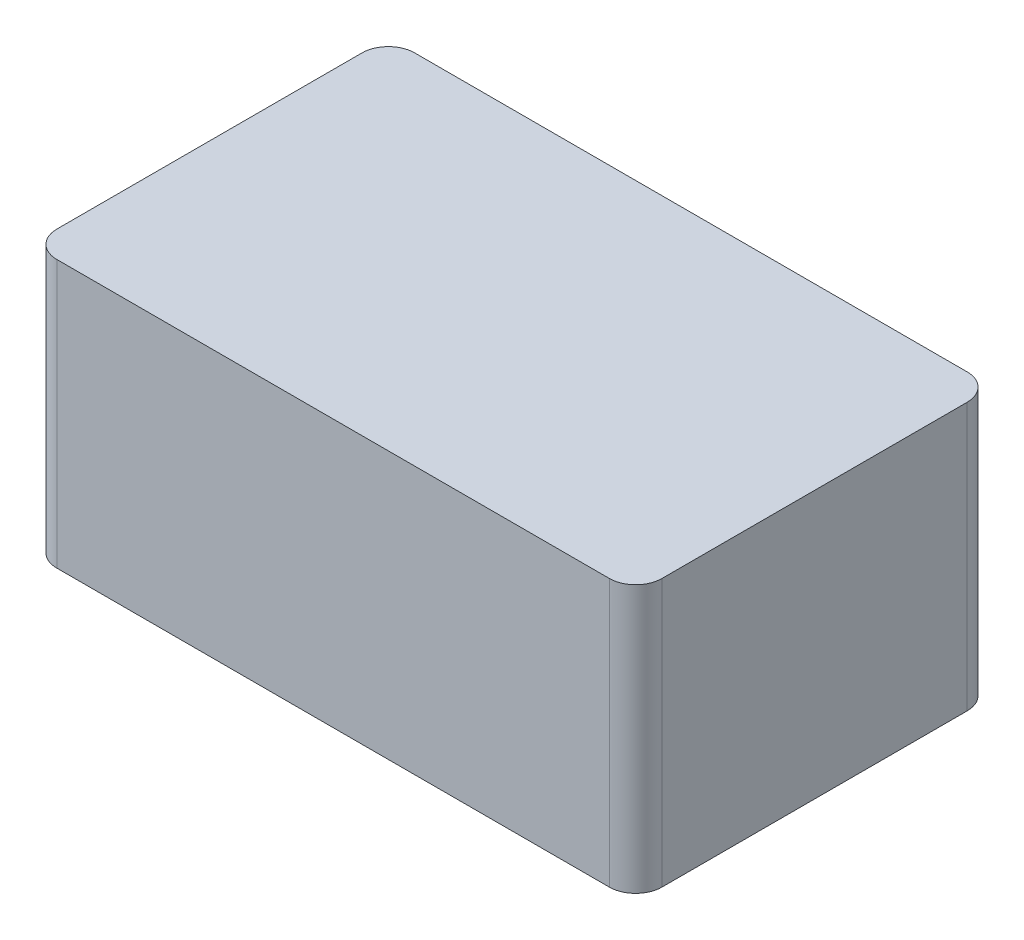
ISO-10303-21;
HEADER;
FILE_DESCRIPTION(('STEP AP214'),'2;1');
FILE_NAME('part.step','',(''),(''),'','','');
FILE_SCHEMA(('AUTOMOTIVE_DESIGN { 1 0 10303 214 1 1 1 1 }'));
ENDSEC;
DATA;
#1=APPLICATION_CONTEXT('core data for automotive mechanical design processes');
#2=APPLICATION_PROTOCOL_DEFINITION('international standard','automotive_design',2000,#1);
#3=PRODUCT_CONTEXT('',#1,'mechanical');
#4=PRODUCT('Part','Part','',(#3));
#5=PRODUCT_RELATED_PRODUCT_CATEGORY('part','',(#4));
#6=PRODUCT_DEFINITION_FORMATION('','',#4);
#7=PRODUCT_DEFINITION_CONTEXT('part definition',#1,'design');
#8=PRODUCT_DEFINITION('design','',#6,#7);
#9=PRODUCT_DEFINITION_SHAPE('','',#8);
#10=(LENGTH_UNIT() NAMED_UNIT(*) SI_UNIT(.MILLI.,.METRE.));
#11=(NAMED_UNIT(*) PLANE_ANGLE_UNIT() SI_UNIT($,.RADIAN.));
#12=(NAMED_UNIT(*) SI_UNIT($,.STERADIAN.) SOLID_ANGLE_UNIT());
#13=UNCERTAINTY_MEASURE_WITH_UNIT(LENGTH_MEASURE(1.E-05),#10,'distance_accuracy_value','');
#14=(GEOMETRIC_REPRESENTATION_CONTEXT(3) GLOBAL_UNCERTAINTY_ASSIGNED_CONTEXT((#13)) GLOBAL_UNIT_ASSIGNED_CONTEXT((#10,
#11,#12)) REPRESENTATION_CONTEXT('',''));
#15=CARTESIAN_POINT('',(0.,0.,0.));
#16=DIRECTION('',(0.,0.,1.));
#17=DIRECTION('',(1.,0.,0.));
#18=AXIS2_PLACEMENT_3D('',#15,#16,#17);
#19=CARTESIAN_POINT('',(-30.0487804878049,50.8,-22.6829268292683));
#20=DIRECTION('',(1.,0.,0.));
#21=DIRECTION('',(0.,0.,-1.));
#22=AXIS2_PLACEMENT_3D('',#19,#20,#21);
#23=PLANE('',#22);
#24=DIRECTION('',(0.,0.,1.));
#25=VECTOR('',#24,1.);
#26=CARTESIAN_POINT('',(-30.0487804878049,50.8,-22.6829268292683));
#27=LINE('',#26,#25);
#28=CARTESIAN_POINT('',(-30.0487804878049,50.8,-17.6829268292683));
#29=VERTEX_POINT('',#28);
#30=CARTESIAN_POINT('',(-30.0487804878049,50.8,40.3170731707317));
#31=VERTEX_POINT('',#30);
#32=EDGE_CURVE('E128',#29,#31,#27,.T.);
#33=ORIENTED_EDGE('',*,*,#32,.F.);
#34=DIRECTION('',(0.,-1.,0.));
#35=VECTOR('',#34,1.);
#36=CARTESIAN_POINT('',(-30.0487804878049,50.8,-17.6829268292683));
#37=LINE('',#36,#35);
#38=CARTESIAN_POINT('',(-30.0487804878049,0.,-17.6829268292683));
#39=VERTEX_POINT('',#38);
#40=EDGE_CURVE('E11',#29,#39,#37,.T.);
#41=ORIENTED_EDGE('',*,*,#40,.T.);
#42=DIRECTION('',(0.,0.,1.));
#43=VECTOR('',#42,1.);
#44=CARTESIAN_POINT('',(-30.0487804878049,0.,-22.6829268292683));
#45=LINE('',#44,#43);
#46=CARTESIAN_POINT('',(-30.0487804878049,0.,40.3170731707317));
#47=VERTEX_POINT('',#46);
#48=EDGE_CURVE('E159',#39,#47,#45,.T.);
#49=ORIENTED_EDGE('',*,*,#48,.T.);
#50=DIRECTION('',(0.,-1.,0.));
#51=VECTOR('',#50,1.);
#52=CARTESIAN_POINT('',(-30.0487804878049,50.8,40.3170731707317));
#53=LINE('',#52,#51);
#54=EDGE_CURVE('E42',#47,#31,#53,.F.);
#55=ORIENTED_EDGE('',*,*,#54,.T.);
#56=EDGE_LOOP('',(#33,#41,#49,#55));
#57=FACE_BOUND('',#56,.T.);
#58=ADVANCED_FACE('F34',(#57),#23,.F.);
#59=CARTESIAN_POINT('',(-30.0487804878049,50.8,45.3170731707317));
#60=DIRECTION('',(0.,0.,-1.));
#61=DIRECTION('',(-1.,0.,0.));
#62=AXIS2_PLACEMENT_3D('',#59,#60,#61);
#63=PLANE('',#62);
#64=DIRECTION('',(1.,0.,0.));
#65=VECTOR('',#64,1.);
#66=CARTESIAN_POINT('',(-30.0487804878049,0.,45.3170731707317));
#67=LINE('',#66,#65);
#68=CARTESIAN_POINT('',(-25.0487804878049,0.,45.3170731707317));
#69=VERTEX_POINT('',#68);
#70=CARTESIAN_POINT('',(79.9512195121951,0.,45.3170731707317));
#71=VERTEX_POINT('',#70);
#72=EDGE_CURVE('E133',#69,#71,#67,.T.);
#73=ORIENTED_EDGE('',*,*,#72,.T.);
#74=DIRECTION('',(0.,-1.,0.));
#75=VECTOR('',#74,1.);
#76=CARTESIAN_POINT('',(79.9512195121951,50.8,45.3170731707317));
#77=LINE('',#76,#75);
#78=CARTESIAN_POINT('',(79.9512195121951,50.8,45.3170731707317));
#79=VERTEX_POINT('',#78);
#80=EDGE_CURVE('E49',#71,#79,#77,.F.);
#81=ORIENTED_EDGE('',*,*,#80,.T.);
#82=DIRECTION('',(1.,0.,0.));
#83=VECTOR('',#82,1.);
#84=CARTESIAN_POINT('',(-30.0487804878049,50.8,45.3170731707317));
#85=LINE('',#84,#83);
#86=CARTESIAN_POINT('',(-25.0487804878049,50.8,45.3170731707317));
#87=VERTEX_POINT('',#86);
#88=EDGE_CURVE('E131',#87,#79,#85,.T.);
#89=ORIENTED_EDGE('',*,*,#88,.F.);
#90=DIRECTION('',(0.,-1.,0.));
#91=VECTOR('',#90,1.);
#92=CARTESIAN_POINT('',(-25.0487804878049,50.8,45.3170731707317));
#93=LINE('',#92,#91);
#94=EDGE_CURVE('E151',#87,#69,#93,.T.);
#95=ORIENTED_EDGE('',*,*,#94,.T.);
#96=EDGE_LOOP('',(#73,#81,#89,#95));
#97=FACE_BOUND('',#96,.T.);
#98=ADVANCED_FACE('F166',(#97),#63,.F.);
#99=CARTESIAN_POINT('',(84.9512195121951,50.8,-22.6829268292683));
#100=DIRECTION('',(-1.,0.,0.));
#101=DIRECTION('',(0.,0.,1.));
#102=AXIS2_PLACEMENT_3D('',#99,#100,#101);
#103=PLANE('',#102);
#104=DIRECTION('',(0.,0.,-1.));
#105=VECTOR('',#104,1.);
#106=CARTESIAN_POINT('',(84.9512195121951,0.,-22.6829268292683));
#107=LINE('',#106,#105);
#108=CARTESIAN_POINT('',(84.9512195121951,0.,40.3170731707317));
#109=VERTEX_POINT('',#108);
#110=CARTESIAN_POINT('',(84.9512195121951,0.,-17.6829268292683));
#111=VERTEX_POINT('',#110);
#112=EDGE_CURVE('E129',#109,#111,#107,.T.);
#113=ORIENTED_EDGE('',*,*,#112,.T.);
#114=DIRECTION('',(0.,-1.,0.));
#115=VECTOR('',#114,1.);
#116=CARTESIAN_POINT('',(84.9512195121951,50.8,-17.6829268292683));
#117=LINE('',#116,#115);
#118=CARTESIAN_POINT('',(84.9512195121951,50.8,-17.6829268292683));
#119=VERTEX_POINT('',#118);
#120=EDGE_CURVE('E106',#111,#119,#117,.F.);
#121=ORIENTED_EDGE('',*,*,#120,.T.);
#122=DIRECTION('',(0.,0.,-1.));
#123=VECTOR('',#122,1.);
#124=CARTESIAN_POINT('',(84.9512195121951,50.8,-22.6829268292683));
#125=LINE('',#124,#123);
#126=CARTESIAN_POINT('',(84.9512195121951,50.8,40.3170731707317));
#127=VERTEX_POINT('',#126);
#128=EDGE_CURVE('E170',#127,#119,#125,.T.);
#129=ORIENTED_EDGE('',*,*,#128,.F.);
#130=DIRECTION('',(0.,-1.,0.));
#131=VECTOR('',#130,1.);
#132=CARTESIAN_POINT('',(84.9512195121951,50.8,40.3170731707317));
#133=LINE('',#132,#131);
#134=EDGE_CURVE('E111',#127,#109,#133,.T.);
#135=ORIENTED_EDGE('',*,*,#134,.T.);
#136=EDGE_LOOP('',(#113,#121,#129,#135));
#137=FACE_BOUND('',#136,.T.);
#138=ADVANCED_FACE('F178',(#137),#103,.F.);
#139=CARTESIAN_POINT('',(-30.0487804878049,50.8,-22.6829268292683));
#140=DIRECTION('',(0.,0.,1.));
#141=DIRECTION('',(1.,0.,0.));
#142=AXIS2_PLACEMENT_3D('',#139,#140,#141);
#143=PLANE('',#142);
#144=DIRECTION('',(-1.,0.,0.));
#145=VECTOR('',#144,1.);
#146=CARTESIAN_POINT('',(-30.0487804878049,50.8,-22.6829268292683));
#147=LINE('',#146,#145);
#148=CARTESIAN_POINT('',(79.9512195121951,50.8,-22.6829268292683));
#149=VERTEX_POINT('',#148);
#150=CARTESIAN_POINT('',(-25.0487804878049,50.8,-22.6829268292683));
#151=VERTEX_POINT('',#150);
#152=EDGE_CURVE('E121',#149,#151,#147,.T.);
#153=ORIENTED_EDGE('',*,*,#152,.F.);
#154=DIRECTION('',(0.,-1.,0.));
#155=VECTOR('',#154,1.);
#156=CARTESIAN_POINT('',(79.9512195121951,50.8,-22.6829268292683));
#157=LINE('',#156,#155);
#158=CARTESIAN_POINT('',(79.9512195121951,0.,-22.6829268292683));
#159=VERTEX_POINT('',#158);
#160=EDGE_CURVE('E105',#149,#159,#157,.T.);
#161=ORIENTED_EDGE('',*,*,#160,.T.);
#162=DIRECTION('',(-1.,0.,0.));
#163=VECTOR('',#162,1.);
#164=CARTESIAN_POINT('',(-30.0487804878049,0.,-22.6829268292683));
#165=LINE('',#164,#163);
#166=CARTESIAN_POINT('',(-25.0487804878049,0.,-22.6829268292683));
#167=VERTEX_POINT('',#166);
#168=EDGE_CURVE('E118',#159,#167,#165,.T.);
#169=ORIENTED_EDGE('',*,*,#168,.T.);
#170=DIRECTION('',(0.,-1.,0.));
#171=VECTOR('',#170,1.);
#172=CARTESIAN_POINT('',(-25.0487804878049,50.8,-22.6829268292683));
#173=LINE('',#172,#171);
#174=EDGE_CURVE('E123',#167,#151,#173,.F.);
#175=ORIENTED_EDGE('',*,*,#174,.T.);
#176=EDGE_LOOP('',(#153,#161,#169,#175));
#177=FACE_BOUND('',#176,.T.);
#178=ADVANCED_FACE('F117',(#177),#143,.F.);
#179=CARTESIAN_POINT('',(0.,50.8,0.));
#180=DIRECTION('',(0.,1.,0.));
#181=DIRECTION('',(0.,0.,1.));
#182=AXIS2_PLACEMENT_3D('',#179,#180,#181);
#183=PLANE('',#182);
#184=ORIENTED_EDGE('',*,*,#128,.T.);
#185=CARTESIAN_POINT('',(79.9512195121951,50.8,-17.6829268292683));
#186=DIRECTION('',(0.,1.,0.));
#187=DIRECTION('',(0.,0.,1.));
#188=AXIS2_PLACEMENT_3D('',#185,#186,#187);
#189=CIRCLE('',#188,5.);
#190=EDGE_CURVE('E149',#119,#149,#189,.T.);
#191=ORIENTED_EDGE('',*,*,#190,.T.);
#192=ORIENTED_EDGE('',*,*,#152,.T.);
#193=CARTESIAN_POINT('',(-25.0487804878049,50.8,-17.6829268292683));
#194=DIRECTION('',(0.,1.,0.));
#195=DIRECTION('',(0.,0.,1.));
#196=AXIS2_PLACEMENT_3D('',#193,#194,#195);
#197=CIRCLE('',#196,5.);
#198=EDGE_CURVE('E145',#151,#29,#197,.T.);
#199=ORIENTED_EDGE('',*,*,#198,.T.);
#200=ORIENTED_EDGE('',*,*,#32,.T.);
#201=CARTESIAN_POINT('',(-25.0487804878049,50.8,40.3170731707317));
#202=DIRECTION('',(0.,1.,0.));
#203=DIRECTION('',(0.,0.,1.));
#204=AXIS2_PLACEMENT_3D('',#201,#202,#203);
#205=CIRCLE('',#204,5.);
#206=EDGE_CURVE('E56',#31,#87,#205,.T.);
#207=ORIENTED_EDGE('',*,*,#206,.T.);
#208=ORIENTED_EDGE('',*,*,#88,.T.);
#209=CARTESIAN_POINT('',(79.9512195121951,50.8,40.3170731707317));
#210=DIRECTION('',(0.,1.,0.));
#211=DIRECTION('',(0.,0.,1.));
#212=AXIS2_PLACEMENT_3D('',#209,#210,#211);
#213=CIRCLE('',#212,5.);
#214=EDGE_CURVE('E147',#79,#127,#213,.T.);
#215=ORIENTED_EDGE('',*,*,#214,.T.);
#216=EDGE_LOOP('',(#184,#191,#192,#199,#200,#207,#208,#215));
#217=FACE_BOUND('',#216,.T.);
#218=ADVANCED_FACE('F162',(#217),#183,.T.);
#219=CARTESIAN_POINT('',(0.,0.,0.));
#220=DIRECTION('',(0.,1.,0.));
#221=DIRECTION('',(0.,0.,1.));
#222=AXIS2_PLACEMENT_3D('',#219,#220,#221);
#223=PLANE('',#222);
#224=ORIENTED_EDGE('',*,*,#168,.F.);
#225=CARTESIAN_POINT('',(79.9512195121951,0.,-17.6829268292683));
#226=DIRECTION('',(0.,1.,0.));
#227=DIRECTION('',(0.,0.,1.));
#228=AXIS2_PLACEMENT_3D('',#225,#226,#227);
#229=CIRCLE('',#228,5.);
#230=EDGE_CURVE('E101',#159,#111,#229,.F.);
#231=ORIENTED_EDGE('',*,*,#230,.T.);
#232=ORIENTED_EDGE('',*,*,#112,.F.);
#233=CARTESIAN_POINT('',(79.9512195121951,0.,40.3170731707317));
#234=DIRECTION('',(0.,1.,0.));
#235=DIRECTION('',(0.,0.,1.));
#236=AXIS2_PLACEMENT_3D('',#233,#234,#235);
#237=CIRCLE('',#236,5.);
#238=EDGE_CURVE('E112',#109,#71,#237,.F.);
#239=ORIENTED_EDGE('',*,*,#238,.T.);
#240=ORIENTED_EDGE('',*,*,#72,.F.);
#241=CARTESIAN_POINT('',(-25.0487804878049,0.,40.3170731707317));
#242=DIRECTION('',(0.,1.,0.));
#243=DIRECTION('',(0.,0.,1.));
#244=AXIS2_PLACEMENT_3D('',#241,#242,#243);
#245=CIRCLE('',#244,5.);
#246=EDGE_CURVE('E122',#69,#47,#245,.F.);
#247=ORIENTED_EDGE('',*,*,#246,.T.);
#248=ORIENTED_EDGE('',*,*,#48,.F.);
#249=CARTESIAN_POINT('',(-25.0487804878049,0.,-17.6829268292683));
#250=DIRECTION('',(0.,1.,0.));
#251=DIRECTION('',(0.,0.,1.));
#252=AXIS2_PLACEMENT_3D('',#249,#250,#251);
#253=CIRCLE('',#252,5.);
#254=EDGE_CURVE('E127',#39,#167,#253,.F.);
#255=ORIENTED_EDGE('',*,*,#254,.T.);
#256=EDGE_LOOP('',(#224,#231,#232,#239,#240,#247,#248,#255));
#257=FACE_BOUND('',#256,.T.);
#258=ADVANCED_FACE('F125',(#257),#223,.F.);
#259=CARTESIAN_POINT('',(79.9512195121951,50.8,-17.6829268292683));
#260=DIRECTION('',(0.,-1.,0.));
#261=DIRECTION('',(0.,0.,-1.));
#262=AXIS2_PLACEMENT_3D('',#259,#260,#261);
#263=CYLINDRICAL_SURFACE('',#262,5.);
#264=ORIENTED_EDGE('',*,*,#190,.F.);
#265=ORIENTED_EDGE('',*,*,#120,.F.);
#266=ORIENTED_EDGE('',*,*,#230,.F.);
#267=ORIENTED_EDGE('',*,*,#160,.F.);
#268=EDGE_LOOP('',(#264,#265,#266,#267));
#269=FACE_BOUND('',#268,.T.);
#270=ADVANCED_FACE('F104',(#269),#263,.T.);
#271=CARTESIAN_POINT('',(79.9512195121951,50.8,40.3170731707317));
#272=DIRECTION('',(0.,-1.,0.));
#273=DIRECTION('',(0.,0.,-1.));
#274=AXIS2_PLACEMENT_3D('',#271,#272,#273);
#275=CYLINDRICAL_SURFACE('',#274,5.);
#276=ORIENTED_EDGE('',*,*,#214,.F.);
#277=ORIENTED_EDGE('',*,*,#80,.F.);
#278=ORIENTED_EDGE('',*,*,#238,.F.);
#279=ORIENTED_EDGE('',*,*,#134,.F.);
#280=EDGE_LOOP('',(#276,#277,#278,#279));
#281=FACE_BOUND('',#280,.T.);
#282=ADVANCED_FACE('F176',(#281),#275,.T.);
#283=CARTESIAN_POINT('',(-25.0487804878049,50.8,-17.6829268292683));
#284=DIRECTION('',(0.,-1.,0.));
#285=DIRECTION('',(0.,0.,-1.));
#286=AXIS2_PLACEMENT_3D('',#283,#284,#285);
#287=CYLINDRICAL_SURFACE('',#286,5.);
#288=ORIENTED_EDGE('',*,*,#198,.F.);
#289=ORIENTED_EDGE('',*,*,#174,.F.);
#290=ORIENTED_EDGE('',*,*,#254,.F.);
#291=ORIENTED_EDGE('',*,*,#40,.F.);
#292=EDGE_LOOP('',(#288,#289,#290,#291));
#293=FACE_BOUND('',#292,.T.);
#294=ADVANCED_FACE('F180',(#293),#287,.T.);
#295=CARTESIAN_POINT('',(-25.0487804878049,50.8,40.3170731707317));
#296=DIRECTION('',(0.,-1.,0.));
#297=DIRECTION('',(0.,0.,-1.));
#298=AXIS2_PLACEMENT_3D('',#295,#296,#297);
#299=CYLINDRICAL_SURFACE('',#298,5.);
#300=ORIENTED_EDGE('',*,*,#206,.F.);
#301=ORIENTED_EDGE('',*,*,#54,.F.);
#302=ORIENTED_EDGE('',*,*,#246,.F.);
#303=ORIENTED_EDGE('',*,*,#94,.F.);
#304=EDGE_LOOP('',(#300,#301,#302,#303));
#305=FACE_BOUND('',#304,.T.);
#306=ADVANCED_FACE('F36',(#305),#299,.T.);
#307=CLOSED_SHELL('',(#58,#98,#138,#178,#218,#258,#270,#282,#294,#306));
#308=MANIFOLD_SOLID_BREP('B2',#307);
#309=ADVANCED_BREP_SHAPE_REPRESENTATION('',(#18,#308),#14);
#310=SHAPE_DEFINITION_REPRESENTATION(#9,#309);
ENDSEC;
END-ISO-10303-21;
